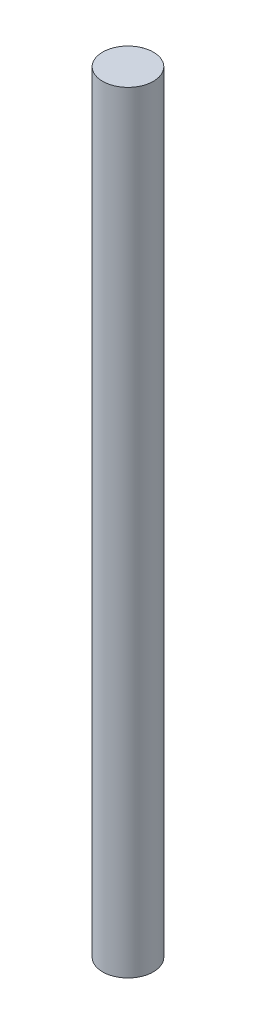
ISO-10303-21;
HEADER;
FILE_DESCRIPTION(('STEP AP214'),'2;1');
FILE_NAME('part.step','',(''),(''),'','','');
FILE_SCHEMA(('AUTOMOTIVE_DESIGN { 1 0 10303 214 1 1 1 1 }'));
ENDSEC;
DATA;
#1=APPLICATION_CONTEXT('core data for automotive mechanical design processes');
#2=APPLICATION_PROTOCOL_DEFINITION('international standard','automotive_design',2000,#1);
#3=PRODUCT_CONTEXT('',#1,'mechanical');
#4=PRODUCT('Part','Part','',(#3));
#5=PRODUCT_RELATED_PRODUCT_CATEGORY('part','',(#4));
#6=PRODUCT_DEFINITION_FORMATION('','',#4);
#7=PRODUCT_DEFINITION_CONTEXT('part definition',#1,'design');
#8=PRODUCT_DEFINITION('design','',#6,#7);
#9=PRODUCT_DEFINITION_SHAPE('','',#8);
#10=(LENGTH_UNIT() NAMED_UNIT(*) SI_UNIT(.MILLI.,.METRE.));
#11=(NAMED_UNIT(*) PLANE_ANGLE_UNIT() SI_UNIT($,.RADIAN.));
#12=(NAMED_UNIT(*) SI_UNIT($,.STERADIAN.) SOLID_ANGLE_UNIT());
#13=UNCERTAINTY_MEASURE_WITH_UNIT(LENGTH_MEASURE(1.E-05),#10,'distance_accuracy_value','');
#14=(GEOMETRIC_REPRESENTATION_CONTEXT(3) GLOBAL_UNCERTAINTY_ASSIGNED_CONTEXT((#13)) GLOBAL_UNIT_ASSIGNED_CONTEXT((#10,
#11,#12)) REPRESENTATION_CONTEXT('',''));
#15=CARTESIAN_POINT('',(0.,0.,0.));
#16=DIRECTION('',(0.,0.,1.));
#17=DIRECTION('',(1.,0.,0.));
#18=AXIS2_PLACEMENT_3D('',#15,#16,#17);
#19=CARTESIAN_POINT('',(-275.4,45.,-83.3333333333333));
#20=DIRECTION('',(0.,1.,0.));
#21=DIRECTION('',(0.,0.,1.));
#22=AXIS2_PLACEMENT_3D('',#19,#20,#21);
#23=PLANE('',#22);
#24=CARTESIAN_POINT('',(-275.4,45.,-83.3333333333333));
#25=DIRECTION('',(0.,1.,0.));
#26=DIRECTION('',(0.,0.,1.));
#27=AXIS2_PLACEMENT_3D('',#24,#25,#26);
#28=CIRCLE('',#27,25.4);
#29=CARTESIAN_POINT('',(-275.4,45.,-57.9333333333333));
#30=VERTEX_POINT('',#29);
#31=EDGE_CURVE('E18',#30,#30,#28,.T.);
#32=ORIENTED_EDGE('',*,*,#31,.F.);
#33=EDGE_LOOP('',(#32));
#34=FACE_BOUND('',#33,.T.);
#35=ADVANCED_FACE('F15',(#34),#23,.F.);
#36=CARTESIAN_POINT('',(-275.4,818.,-83.3333333333333));
#37=DIRECTION('',(0.,1.,0.));
#38=DIRECTION('',(0.,0.,1.));
#39=AXIS2_PLACEMENT_3D('',#36,#37,#38);
#40=PLANE('',#39);
#41=CARTESIAN_POINT('',(-275.4,818.,-83.3333333333333));
#42=DIRECTION('',(0.,1.,0.));
#43=DIRECTION('',(0.,0.,1.));
#44=AXIS2_PLACEMENT_3D('',#41,#42,#43);
#45=CIRCLE('',#44,25.4);
#46=CARTESIAN_POINT('',(-275.4,818.,-57.9333333333333));
#47=VERTEX_POINT('',#46);
#48=EDGE_CURVE('E10',#47,#47,#45,.F.);
#49=ORIENTED_EDGE('',*,*,#48,.F.);
#50=EDGE_LOOP('',(#49));
#51=FACE_BOUND('',#50,.T.);
#52=ADVANCED_FACE('F30',(#51),#40,.T.);
#53=CARTESIAN_POINT('',(-275.4,18.,-83.3333333333333));
#54=DIRECTION('',(0.,1.,0.));
#55=DIRECTION('',(0.,0.,1.));
#56=AXIS2_PLACEMENT_3D('',#53,#54,#55);
#57=CYLINDRICAL_SURFACE('',#56,25.4);
#58=ORIENTED_EDGE('',*,*,#48,.T.);
#59=EDGE_LOOP('',(#58));
#60=FACE_BOUND('',#59,.T.);
#61=ORIENTED_EDGE('',*,*,#31,.T.);
#62=EDGE_LOOP('',(#61));
#63=FACE_BOUND('',#62,.T.);
#64=ADVANCED_FACE('F27',(#60,#63),#57,.T.);
#65=CLOSED_SHELL('',(#35,#52,#64));
#66=MANIFOLD_SOLID_BREP('B1',#65);
#67=ADVANCED_BREP_SHAPE_REPRESENTATION('',(#18,#66),#14);
#68=SHAPE_DEFINITION_REPRESENTATION(#9,#67);
ENDSEC;
END-ISO-10303-21;
